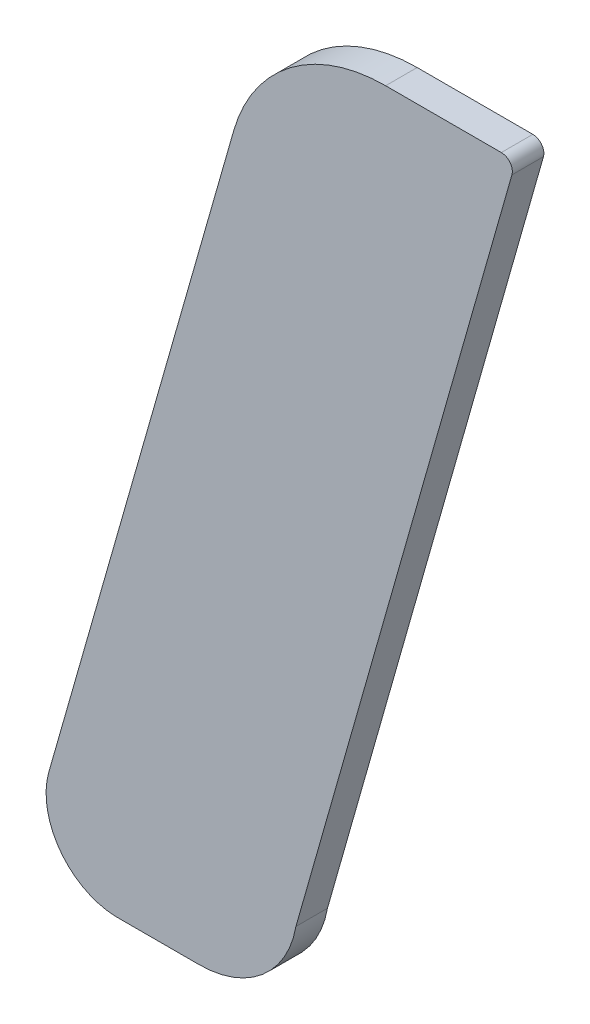
ISO-10303-21;
HEADER;
FILE_DESCRIPTION(('STEP AP214'),'2;1');
FILE_NAME('part.step','',(''),(''),'','','');
FILE_SCHEMA(('AUTOMOTIVE_DESIGN { 1 0 10303 214 1 1 1 1 }'));
ENDSEC;
DATA;
#1=APPLICATION_CONTEXT('core data for automotive mechanical design processes');
#2=APPLICATION_PROTOCOL_DEFINITION('international standard','automotive_design',2000,#1);
#3=PRODUCT_CONTEXT('',#1,'mechanical');
#4=PRODUCT('Part','Part','',(#3));
#5=PRODUCT_RELATED_PRODUCT_CATEGORY('part','',(#4));
#6=PRODUCT_DEFINITION_FORMATION('','',#4);
#7=PRODUCT_DEFINITION_CONTEXT('part definition',#1,'design');
#8=PRODUCT_DEFINITION('design','',#6,#7);
#9=PRODUCT_DEFINITION_SHAPE('','',#8);
#10=(LENGTH_UNIT() NAMED_UNIT(*) SI_UNIT(.MILLI.,.METRE.));
#11=(NAMED_UNIT(*) PLANE_ANGLE_UNIT() SI_UNIT($,.RADIAN.));
#12=(NAMED_UNIT(*) SI_UNIT($,.STERADIAN.) SOLID_ANGLE_UNIT());
#13=UNCERTAINTY_MEASURE_WITH_UNIT(LENGTH_MEASURE(1.E-05),#10,'distance_accuracy_value','');
#14=(GEOMETRIC_REPRESENTATION_CONTEXT(3) GLOBAL_UNCERTAINTY_ASSIGNED_CONTEXT((#13)) GLOBAL_UNIT_ASSIGNED_CONTEXT((#10,
#11,#12)) REPRESENTATION_CONTEXT('',''));
#15=CARTESIAN_POINT('',(0.,0.,0.));
#16=DIRECTION('',(0.,0.,1.));
#17=DIRECTION('',(1.,0.,0.));
#18=AXIS2_PLACEMENT_3D('',#15,#16,#17);
#19=CARTESIAN_POINT('',(6.57767882328018,12.2420163700719,4.75));
#20=DIRECTION('',(0.,0.,1.));
#21=DIRECTION('',(1.,0.,0.));
#22=AXIS2_PLACEMENT_3D('',#19,#20,#21);
#23=PLANE('',#22);
#24=CARTESIAN_POINT('',(6.57767882328018,12.2420163700719,4.75));
#25=DIRECTION('',(0.,0.,1.));
#26=DIRECTION('',(0.00011036422932764,0.999999993909868,0.));
#27=AXIS2_PLACEMENT_3D('',#24,#25,#26);
#28=CIRCLE('',#27,0.0100162142829732);
#29=CARTESIAN_POINT('',(6.57767992871195,12.2520325842939,4.75));
#30=VERTEX_POINT('',#29);
#31=CARTESIAN_POINT('',(6.56803314012955,12.2447155079194,4.75));
#32=VERTEX_POINT('',#31);
#33=EDGE_CURVE('E11',#30,#32,#28,.T.);
#34=ORIENTED_EDGE('',*,*,#33,.F.);
#35=DIRECTION('',(-0.999999993909869,0.000110364225028997,0.));
#36=VECTOR('',#35,1.);
#37=CARTESIAN_POINT('',(6.58501933037867,12.2520317742865,4.75));
#38=LINE('',#37,#36);
#39=CARTESIAN_POINT('',(6.58501933037867,12.2520317742865,4.75));
#40=VERTEX_POINT('',#39);
#41=EDGE_CURVE('E149',#40,#30,#38,.T.);
#42=ORIENTED_EDGE('',*,*,#41,.F.);
#43=CARTESIAN_POINT('',(6.58501925312371,12.2513317742908,4.75));
#44=DIRECTION('',(0.,0.,1.));
#45=DIRECTION('',(0.96180259240971,-0.273743992142223,0.));
#46=AXIS2_PLACEMENT_3D('',#43,#44,#45);
#47=CIRCLE('',#46,0.000700000000000006);
#48=CARTESIAN_POINT('',(6.5856925149384,12.2511401534963,4.75));
#49=VERTEX_POINT('',#48);
#50=EDGE_CURVE('E142',#49,#40,#47,.T.);
#51=ORIENTED_EDGE('',*,*,#50,.F.);
#52=DIRECTION('',(0.27374399211542,0.961802592417339,0.));
#53=VECTOR('',#52,1.);
#54=CARTESIAN_POINT('',(6.57198843068078,12.2029906994614,4.75));
#55=LINE('',#54,#53);
#56=CARTESIAN_POINT('',(6.57198843068078,12.2029906994614,4.75));
#57=VERTEX_POINT('',#56);
#58=EDGE_CURVE('E133',#57,#49,#55,.T.);
#59=ORIENTED_EDGE('',*,*,#58,.F.);
#60=CARTESIAN_POINT('',(6.56584058755796,12.2040639641754,4.75));
#61=DIRECTION('',(0.,0.,1.));
#62=DIRECTION('',(-4.83879547283342E-12,-1.,0.));
#63=AXIS2_PLACEMENT_3D('',#60,#61,#62);
#64=CIRCLE('',#63,0.00624082303940007);
#65=CARTESIAN_POINT('',(6.56584058755793,12.197823141136,4.75));
#66=VERTEX_POINT('',#65);
#67=EDGE_CURVE('E124',#66,#57,#64,.T.);
#68=ORIENTED_EDGE('',*,*,#67,.F.);
#69=DIRECTION('',(1.,0.,0.));
#70=VECTOR('',#69,1.);
#71=CARTESIAN_POINT('',(6.56052542025171,12.197823141136,4.75));
#72=LINE('',#71,#70);
#73=CARTESIAN_POINT('',(6.56052542025171,12.197823141136,4.75));
#74=VERTEX_POINT('',#73);
#75=EDGE_CURVE('E115',#74,#66,#72,.T.);
#76=ORIENTED_EDGE('',*,*,#75,.F.);
#77=CARTESIAN_POINT('',(6.5607086804546,12.2023906064361,4.75));
#78=DIRECTION('',(0.,0.,1.));
#79=DIRECTION('',(-0.961612413228531,0.274411309396681,0.));
#80=AXIS2_PLACEMENT_3D('',#77,#78,#79);
#81=CIRCLE('',#80,0.00457114029211118);
#82=CARTESIAN_POINT('',(6.55631301520708,12.2036449790291,4.75));
#83=VERTEX_POINT('',#82);
#84=EDGE_CURVE('E106',#83,#74,#81,.T.);
#85=ORIENTED_EDGE('',*,*,#84,.F.);
#86=DIRECTION('',(-0.274411309388005,-0.961612413231007,0.));
#87=VECTOR('',#86,1.);
#88=CARTESIAN_POINT('',(6.56803314012955,12.2447155079194,4.75));
#89=LINE('',#88,#87);
#90=EDGE_CURVE('E86',#32,#83,#89,.T.);
#91=ORIENTED_EDGE('',*,*,#90,.F.);
#92=EDGE_LOOP('',(#34,#42,#51,#59,#68,#76,#85,#91));
#93=FACE_BOUND('',#92,.T.);
#94=ADVANCED_FACE('F17',(#93),#23,.F.);
#95=CARTESIAN_POINT('',(6.58501933037867,12.2520317742865,4.83252449867128));
#96=DIRECTION('',(-0.000110364224950601,-0.999999993909869,0.));
#97=DIRECTION('',(0.999999993909869,-0.000110364224950601,0.));
#98=AXIS2_PLACEMENT_3D('',#95,#96,#97);
#99=PLANE('',#98);
#100=DIRECTION('',(0.,0.,-1.));
#101=VECTOR('',#100,1.);
#102=CARTESIAN_POINT('',(6.57767992871195,12.2520325842939,4.752));
#103=LINE('',#102,#101);
#104=CARTESIAN_POINT('',(6.57767992871195,12.2520325842939,4.752));
#105=VERTEX_POINT('',#104);
#106=EDGE_CURVE('E24',#105,#30,#103,.T.);
#107=ORIENTED_EDGE('',*,*,#106,.F.);
#108=DIRECTION('',(0.999999993909869,-0.00011036422502901,-1.21015098317681E-13));
#109=VECTOR('',#108,1.);
#110=CARTESIAN_POINT('',(6.57767992871195,12.2520325842939,4.752));
#111=LINE('',#110,#109);
#112=CARTESIAN_POINT('',(6.58501933037867,12.2520317742865,4.752));
#113=VERTEX_POINT('',#112);
#114=EDGE_CURVE('E99',#105,#113,#111,.T.);
#115=ORIENTED_EDGE('',*,*,#114,.T.);
#116=DIRECTION('',(0.,0.,-1.));
#117=VECTOR('',#116,1.);
#118=CARTESIAN_POINT('',(6.58501933037867,12.2520317742865,4.752));
#119=LINE('',#118,#117);
#120=EDGE_CURVE('E146',#113,#40,#119,.T.);
#121=ORIENTED_EDGE('',*,*,#120,.T.);
#122=ORIENTED_EDGE('',*,*,#41,.T.);
#123=EDGE_LOOP('',(#107,#115,#121,#122));
#124=FACE_BOUND('',#123,.T.);
#125=ADVANCED_FACE('F150',(#124),#99,.F.);
#126=CARTESIAN_POINT('',(6.58501925312371,12.2513317742908,4.83252449867128));
#127=DIRECTION('',(0.,0.,-1.));
#128=DIRECTION('',(0.79807585449164,0.602556993551181,0.));
#129=AXIS2_PLACEMENT_3D('',#126,#127,#128);
#130=CYLINDRICAL_SURFACE('',#129,0.000700000000000006);
#131=ORIENTED_EDGE('',*,*,#120,.F.);
#132=CARTESIAN_POINT('',(6.58501925312371,12.2513317742908,4.752));
#133=DIRECTION('',(0.,0.,-1.));
#134=DIRECTION('',(0.000110364229501316,0.999999993909868,0.));
#135=AXIS2_PLACEMENT_3D('',#132,#133,#134);
#136=CIRCLE('',#135,0.000700000000000006);
#137=CARTESIAN_POINT('',(6.5856925149384,12.2511401534963,4.752));
#138=VERTEX_POINT('',#137);
#139=EDGE_CURVE('E136',#113,#138,#136,.T.);
#140=ORIENTED_EDGE('',*,*,#139,.T.);
#141=DIRECTION('',(0.,-8.88178419699829E-13,-1.));
#142=VECTOR('',#141,1.);
#143=CARTESIAN_POINT('',(6.5856925149384,12.2511401534963,4.752));
#144=LINE('',#143,#142);
#145=EDGE_CURVE('E139',#138,#49,#144,.T.);
#146=ORIENTED_EDGE('',*,*,#145,.T.);
#147=ORIENTED_EDGE('',*,*,#50,.T.);
#148=EDGE_LOOP('',(#131,#140,#146,#147));
#149=FACE_BOUND('',#148,.T.);
#150=ADVANCED_FACE('F152',(#149),#130,.T.);
#151=CARTESIAN_POINT('',(6.57198843068078,12.2029906994614,4.83252449867128));
#152=DIRECTION('',(-0.961802592417337,0.273743992115426,0.));
#153=DIRECTION('',(-0.273743992115426,-0.961802592417337,0.));
#154=AXIS2_PLACEMENT_3D('',#151,#152,#153);
#155=PLANE('',#154);
#156=ORIENTED_EDGE('',*,*,#145,.F.);
#157=DIRECTION('',(-0.273743992115436,-0.961802592417334,0.));
#158=VECTOR('',#157,1.);
#159=CARTESIAN_POINT('',(6.58569251493841,12.2511401534963,4.752));
#160=LINE('',#159,#158);
#161=CARTESIAN_POINT('',(6.57198843068078,12.2029906994614,4.752));
#162=VERTEX_POINT('',#161);
#163=EDGE_CURVE('E127',#138,#162,#160,.T.);
#164=ORIENTED_EDGE('',*,*,#163,.T.);
#165=DIRECTION('',(4.44089209849914E-13,-8.88178419699829E-13,-1.));
#166=VECTOR('',#165,1.);
#167=CARTESIAN_POINT('',(6.57198843068078,12.2029906994614,4.752));
#168=LINE('',#167,#166);
#169=EDGE_CURVE('E130',#162,#57,#168,.T.);
#170=ORIENTED_EDGE('',*,*,#169,.T.);
#171=ORIENTED_EDGE('',*,*,#58,.T.);
#172=EDGE_LOOP('',(#156,#164,#170,#171));
#173=FACE_BOUND('',#172,.T.);
#174=ADVANCED_FACE('F155',(#173),#155,.F.);
#175=CARTESIAN_POINT('',(6.56584058755796,12.2040639641754,4.83252449867128));
#176=DIRECTION('',(0.,0.,-1.));
#177=DIRECTION('',(-1.,0.,0.));
#178=AXIS2_PLACEMENT_3D('',#175,#176,#177);
#179=CYLINDRICAL_SURFACE('',#178,0.00624082303940007);
#180=ORIENTED_EDGE('',*,*,#169,.F.);
#181=CARTESIAN_POINT('',(6.56584058755796,12.2040639641754,4.752));
#182=DIRECTION('',(0.,0.,-1.));
#183=DIRECTION('',(0.985101337436691,-0.171974867292993,0.));
#184=AXIS2_PLACEMENT_3D('',#181,#182,#183);
#185=CIRCLE('',#184,0.00624082303940007);
#186=CARTESIAN_POINT('',(6.56584058755793,12.197823141136,4.752));
#187=VERTEX_POINT('',#186);
#188=EDGE_CURVE('E118',#162,#187,#185,.T.);
#189=ORIENTED_EDGE('',*,*,#188,.T.);
#190=DIRECTION('',(0.,0.,-1.));
#191=VECTOR('',#190,1.);
#192=CARTESIAN_POINT('',(6.56584058755793,12.197823141136,4.752));
#193=LINE('',#192,#191);
#194=EDGE_CURVE('E121',#187,#66,#193,.T.);
#195=ORIENTED_EDGE('',*,*,#194,.T.);
#196=ORIENTED_EDGE('',*,*,#67,.T.);
#197=EDGE_LOOP('',(#180,#189,#195,#196));
#198=FACE_BOUND('',#197,.T.);
#199=ADVANCED_FACE('F158',(#198),#179,.T.);
#200=CARTESIAN_POINT('',(6.56052542025171,12.197823141136,4.83252449867128));
#201=DIRECTION('',(0.,1.,0.));
#202=DIRECTION('',(0.,0.,1.));
#203=AXIS2_PLACEMENT_3D('',#200,#201,#202);
#204=PLANE('',#203);
#205=ORIENTED_EDGE('',*,*,#194,.F.);
#206=DIRECTION('',(-1.,0.,0.));
#207=VECTOR('',#206,1.);
#208=CARTESIAN_POINT('',(6.56584058755793,12.197823141136,4.752));
#209=LINE('',#208,#207);
#210=CARTESIAN_POINT('',(6.56052542025171,12.197823141136,4.752));
#211=VERTEX_POINT('',#210);
#212=EDGE_CURVE('E109',#187,#211,#209,.T.);
#213=ORIENTED_EDGE('',*,*,#212,.T.);
#214=DIRECTION('',(-4.44089209849914E-13,0.,-1.));
#215=VECTOR('',#214,1.);
#216=CARTESIAN_POINT('',(6.56052542025171,12.197823141136,4.752));
#217=LINE('',#216,#215);
#218=EDGE_CURVE('E112',#211,#74,#217,.T.);
#219=ORIENTED_EDGE('',*,*,#218,.T.);
#220=ORIENTED_EDGE('',*,*,#75,.T.);
#221=EDGE_LOOP('',(#205,#213,#219,#220));
#222=FACE_BOUND('',#221,.T.);
#223=ADVANCED_FACE('F160',(#222),#204,.F.);
#224=CARTESIAN_POINT('',(6.5607086804546,12.2023906064361,4.83252449867128));
#225=DIRECTION('',(0.,0.,-1.));
#226=DIRECTION('',(-1.,0.,0.));
#227=AXIS2_PLACEMENT_3D('',#224,#225,#226);
#228=CYLINDRICAL_SURFACE('',#227,0.00457114029211118);
#229=ORIENTED_EDGE('',*,*,#218,.F.);
#230=CARTESIAN_POINT('',(6.5607086804546,12.2023906064361,4.752));
#231=DIRECTION('',(0.,0.,-1.));
#232=DIRECTION('',(-0.0400906975463138,-0.999196044813154,0.));
#233=AXIS2_PLACEMENT_3D('',#230,#231,#232);
#234=CIRCLE('',#233,0.00457114029211118);
#235=CARTESIAN_POINT('',(6.55631301520708,12.2036449790291,4.752));
#236=VERTEX_POINT('',#235);
#237=EDGE_CURVE('E103',#211,#236,#234,.T.);
#238=ORIENTED_EDGE('',*,*,#237,.T.);
#239=DIRECTION('',(-4.44089209849914E-13,0.,-1.));
#240=VECTOR('',#239,1.);
#241=CARTESIAN_POINT('',(6.55631301520708,12.2036449790291,4.752));
#242=LINE('',#241,#240);
#243=EDGE_CURVE('E92',#236,#83,#242,.T.);
#244=ORIENTED_EDGE('',*,*,#243,.T.);
#245=ORIENTED_EDGE('',*,*,#84,.T.);
#246=EDGE_LOOP('',(#229,#238,#244,#245));
#247=FACE_BOUND('',#246,.T.);
#248=ADVANCED_FACE('F163',(#247),#228,.T.);
#249=CARTESIAN_POINT('',(6.56803314012955,12.2447155079194,4.83252449867128));
#250=DIRECTION('',(0.961612413231008,-0.274411309388002,0.));
#251=DIRECTION('',(0.274411309388002,0.961612413231008,0.));
#252=AXIS2_PLACEMENT_3D('',#249,#250,#251);
#253=PLANE('',#252);
#254=ORIENTED_EDGE('',*,*,#243,.F.);
#255=DIRECTION('',(0.274411309388016,0.961612413231004,0.));
#256=VECTOR('',#255,1.);
#257=CARTESIAN_POINT('',(6.5563130152071,12.2036449790291,4.752));
#258=LINE('',#257,#256);
#259=CARTESIAN_POINT('',(6.56803314012955,12.2447155079194,4.752));
#260=VERTEX_POINT('',#259);
#261=EDGE_CURVE('E87',#236,#260,#258,.T.);
#262=ORIENTED_EDGE('',*,*,#261,.T.);
#263=DIRECTION('',(4.44089209849914E-13,0.,-1.));
#264=VECTOR('',#263,1.);
#265=CARTESIAN_POINT('',(6.56803314012955,12.2447155079194,4.752));
#266=LINE('',#265,#264);
#267=EDGE_CURVE('E78',#260,#32,#266,.T.);
#268=ORIENTED_EDGE('',*,*,#267,.T.);
#269=ORIENTED_EDGE('',*,*,#90,.T.);
#270=EDGE_LOOP('',(#254,#262,#268,#269));
#271=FACE_BOUND('',#270,.T.);
#272=ADVANCED_FACE('F90',(#271),#253,.F.);
#273=CARTESIAN_POINT('',(6.57767882328018,12.2420163700719,4.83252449867128));
#274=DIRECTION('',(0.,0.,-1.));
#275=DIRECTION('',(-1.,0.,0.));
#276=AXIS2_PLACEMENT_3D('',#273,#274,#275);
#277=CYLINDRICAL_SURFACE('',#276,0.0100162142829732);
#278=ORIENTED_EDGE('',*,*,#267,.F.);
#279=CARTESIAN_POINT('',(6.57767882328018,12.2420163700719,4.752));
#280=DIRECTION('',(0.,0.,-1.));
#281=DIRECTION('',(-0.96300686847729,0.269476847364597,0.));
#282=AXIS2_PLACEMENT_3D('',#279,#280,#281);
#283=CIRCLE('',#282,0.0100162142829732);
#284=EDGE_CURVE('E82',#260,#105,#283,.T.);
#285=ORIENTED_EDGE('',*,*,#284,.T.);
#286=ORIENTED_EDGE('',*,*,#106,.T.);
#287=ORIENTED_EDGE('',*,*,#33,.T.);
#288=EDGE_LOOP('',(#278,#285,#286,#287));
#289=FACE_BOUND('',#288,.T.);
#290=ADVANCED_FACE('F80',(#289),#277,.T.);
#291=CARTESIAN_POINT('',(5.86959286961936,12.1314924009898,4.752));
#292=DIRECTION('',(0.,0.,-1.));
#293=DIRECTION('',(-1.,0.,0.));
#294=AXIS2_PLACEMENT_3D('',#291,#292,#293);
#295=PLANE('',#294);
#296=ORIENTED_EDGE('',*,*,#261,.F.);
#297=ORIENTED_EDGE('',*,*,#237,.F.);
#298=ORIENTED_EDGE('',*,*,#212,.F.);
#299=ORIENTED_EDGE('',*,*,#188,.F.);
#300=ORIENTED_EDGE('',*,*,#163,.F.);
#301=ORIENTED_EDGE('',*,*,#139,.F.);
#302=ORIENTED_EDGE('',*,*,#114,.F.);
#303=ORIENTED_EDGE('',*,*,#284,.F.);
#304=EDGE_LOOP('',(#296,#297,#298,#299,#300,#301,#302,#303));
#305=FACE_BOUND('',#304,.T.);
#306=ADVANCED_FACE('F97',(#305),#295,.F.);
#307=CLOSED_SHELL('',(#94,#125,#150,#174,#199,#223,#248,#272,#290,#306));
#308=MANIFOLD_SOLID_BREP('B1',#307);
#309=ADVANCED_BREP_SHAPE_REPRESENTATION('',(#18,#308),#14);
#310=SHAPE_DEFINITION_REPRESENTATION(#9,#309);
ENDSEC;
END-ISO-10303-21;
